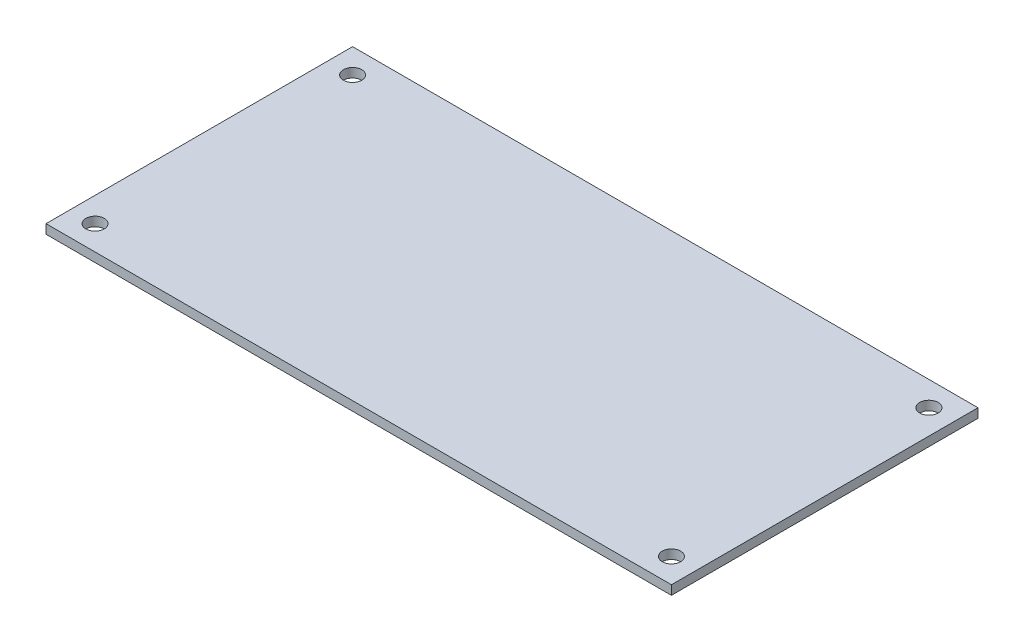
ISO-10303-21;
HEADER;
FILE_DESCRIPTION(('STEP AP214'),'2;1');
FILE_NAME('part.step','',(''),(''),'','','');
FILE_SCHEMA(('AUTOMOTIVE_DESIGN { 1 0 10303 214 1 1 1 1 }'));
ENDSEC;
DATA;
#1=APPLICATION_CONTEXT('core data for automotive mechanical design processes');
#2=APPLICATION_PROTOCOL_DEFINITION('international standard','automotive_design',2000,#1);
#3=PRODUCT_CONTEXT('',#1,'mechanical');
#4=PRODUCT('Part','Part','',(#3));
#5=PRODUCT_RELATED_PRODUCT_CATEGORY('part','',(#4));
#6=PRODUCT_DEFINITION_FORMATION('','',#4);
#7=PRODUCT_DEFINITION_CONTEXT('part definition',#1,'design');
#8=PRODUCT_DEFINITION('design','',#6,#7);
#9=PRODUCT_DEFINITION_SHAPE('','',#8);
#10=(LENGTH_UNIT() NAMED_UNIT(*) SI_UNIT(.MILLI.,.METRE.));
#11=(NAMED_UNIT(*) PLANE_ANGLE_UNIT() SI_UNIT($,.RADIAN.));
#12=(NAMED_UNIT(*) SI_UNIT($,.STERADIAN.) SOLID_ANGLE_UNIT());
#13=UNCERTAINTY_MEASURE_WITH_UNIT(LENGTH_MEASURE(1.E-05),#10,'distance_accuracy_value','');
#14=(GEOMETRIC_REPRESENTATION_CONTEXT(3) GLOBAL_UNCERTAINTY_ASSIGNED_CONTEXT((#13)) GLOBAL_UNIT_ASSIGNED_CONTEXT((#10,
#11,#12)) REPRESENTATION_CONTEXT('',''));
#15=CARTESIAN_POINT('',(0.,0.,0.));
#16=DIRECTION('',(0.,0.,1.));
#17=DIRECTION('',(1.,0.,0.));
#18=AXIS2_PLACEMENT_3D('',#15,#16,#17);
#19=CARTESIAN_POINT('',(0.,1.5,0.));
#20=DIRECTION('',(0.,-1.,0.));
#21=DIRECTION('',(0.,0.,-1.));
#22=AXIS2_PLACEMENT_3D('',#19,#20,#21);
#23=PLANE('',#22);
#24=CARTESIAN_POINT('',(47.,1.5,21.));
#25=DIRECTION('',(0.,1.,0.));
#26=DIRECTION('',(0.,0.,1.));
#27=AXIS2_PLACEMENT_3D('',#24,#25,#26);
#28=CIRCLE('',#27,1.5);
#29=CARTESIAN_POINT('',(47.,1.5,22.5));
#30=VERTEX_POINT('',#29);
#31=EDGE_CURVE('E120',#30,#30,#28,.T.);
#32=ORIENTED_EDGE('',*,*,#31,.F.);
#33=EDGE_LOOP('',(#32));
#34=FACE_BOUND('',#33,.T.);
#35=CARTESIAN_POINT('',(-47.,1.5,-21.));
#36=DIRECTION('',(0.,1.,0.));
#37=DIRECTION('',(0.,0.,1.));
#38=AXIS2_PLACEMENT_3D('',#35,#36,#37);
#39=CIRCLE('',#38,1.5);
#40=CARTESIAN_POINT('',(-47.,1.5,-19.5));
#41=VERTEX_POINT('',#40);
#42=EDGE_CURVE('E99',#41,#41,#39,.T.);
#43=ORIENTED_EDGE('',*,*,#42,.F.);
#44=EDGE_LOOP('',(#43));
#45=FACE_BOUND('',#44,.T.);
#46=DIRECTION('',(0.,0.,-1.));
#47=VECTOR('',#46,1.);
#48=CARTESIAN_POINT('',(51.,1.5,25.));
#49=LINE('',#48,#47);
#50=CARTESIAN_POINT('',(51.,1.5,25.));
#51=VERTEX_POINT('',#50);
#52=CARTESIAN_POINT('',(51.,1.5,-25.));
#53=VERTEX_POINT('',#52);
#54=EDGE_CURVE('E84',#51,#53,#49,.T.);
#55=ORIENTED_EDGE('',*,*,#54,.T.);
#56=DIRECTION('',(-1.,0.,0.));
#57=VECTOR('',#56,1.);
#58=CARTESIAN_POINT('',(-51.,1.5,-25.));
#59=LINE('',#58,#57);
#60=CARTESIAN_POINT('',(-51.,1.5,-25.));
#61=VERTEX_POINT('',#60);
#62=EDGE_CURVE('E79',#53,#61,#59,.T.);
#63=ORIENTED_EDGE('',*,*,#62,.T.);
#64=DIRECTION('',(0.,0.,1.));
#65=VECTOR('',#64,1.);
#66=CARTESIAN_POINT('',(-51.,1.5,25.));
#67=LINE('',#66,#65);
#68=CARTESIAN_POINT('',(-51.,1.5,25.));
#69=VERTEX_POINT('',#68);
#70=EDGE_CURVE('E82',#61,#69,#67,.T.);
#71=ORIENTED_EDGE('',*,*,#70,.T.);
#72=DIRECTION('',(1.,0.,0.));
#73=VECTOR('',#72,1.);
#74=CARTESIAN_POINT('',(-51.,1.5,25.));
#75=LINE('',#74,#73);
#76=EDGE_CURVE('E49',#69,#51,#75,.T.);
#77=ORIENTED_EDGE('',*,*,#76,.T.);
#78=EDGE_LOOP('',(#55,#63,#71,#77));
#79=FACE_BOUND('',#78,.T.);
#80=CARTESIAN_POINT('',(47.,1.5,-21.));
#81=DIRECTION('',(0.,1.,0.));
#82=DIRECTION('',(0.,0.,-1.));
#83=AXIS2_PLACEMENT_3D('',#80,#81,#82);
#84=CIRCLE('',#83,1.5);
#85=CARTESIAN_POINT('',(47.,1.5,-22.5));
#86=VERTEX_POINT('',#85);
#87=EDGE_CURVE('E114',#86,#86,#84,.T.);
#88=ORIENTED_EDGE('',*,*,#87,.F.);
#89=EDGE_LOOP('',(#88));
#90=FACE_BOUND('',#89,.T.);
#91=CARTESIAN_POINT('',(-47.,1.5,21.));
#92=DIRECTION('',(0.,1.,0.));
#93=DIRECTION('',(0.,0.,-1.));
#94=AXIS2_PLACEMENT_3D('',#91,#92,#93);
#95=CIRCLE('',#94,1.5);
#96=CARTESIAN_POINT('',(-47.,1.5,19.5));
#97=VERTEX_POINT('',#96);
#98=EDGE_CURVE('E126',#97,#97,#95,.T.);
#99=ORIENTED_EDGE('',*,*,#98,.F.);
#100=EDGE_LOOP('',(#99));
#101=FACE_BOUND('',#100,.T.);
#102=ADVANCED_FACE('F32',(#34,#45,#79,#90,#101),#23,.F.);
#103=CARTESIAN_POINT('',(0.,0.,0.));
#104=DIRECTION('',(0.,-1.,0.));
#105=DIRECTION('',(0.,0.,-1.));
#106=AXIS2_PLACEMENT_3D('',#103,#104,#105);
#107=PLANE('',#106);
#108=CARTESIAN_POINT('',(47.,0.,21.));
#109=DIRECTION('',(0.,1.,0.));
#110=DIRECTION('',(0.,0.,1.));
#111=AXIS2_PLACEMENT_3D('',#108,#109,#110);
#112=CIRCLE('',#111,1.5);
#113=CARTESIAN_POINT('',(47.,0.,22.5));
#114=VERTEX_POINT('',#113);
#115=EDGE_CURVE('E123',#114,#114,#112,.T.);
#116=ORIENTED_EDGE('',*,*,#115,.T.);
#117=EDGE_LOOP('',(#116));
#118=FACE_BOUND('',#117,.T.);
#119=CARTESIAN_POINT('',(-47.,0.,-21.));
#120=DIRECTION('',(0.,1.,0.));
#121=DIRECTION('',(0.,0.,1.));
#122=AXIS2_PLACEMENT_3D('',#119,#120,#121);
#123=CIRCLE('',#122,1.5);
#124=CARTESIAN_POINT('',(-47.,0.,-19.5));
#125=VERTEX_POINT('',#124);
#126=EDGE_CURVE('E111',#125,#125,#123,.T.);
#127=ORIENTED_EDGE('',*,*,#126,.T.);
#128=EDGE_LOOP('',(#127));
#129=FACE_BOUND('',#128,.T.);
#130=DIRECTION('',(0.,0.,-1.));
#131=VECTOR('',#130,1.);
#132=CARTESIAN_POINT('',(51.,0.,25.));
#133=LINE('',#132,#131);
#134=CARTESIAN_POINT('',(51.,0.,25.));
#135=VERTEX_POINT('',#134);
#136=CARTESIAN_POINT('',(51.,0.,-25.));
#137=VERTEX_POINT('',#136);
#138=EDGE_CURVE('E96',#135,#137,#133,.T.);
#139=ORIENTED_EDGE('',*,*,#138,.F.);
#140=DIRECTION('',(1.,0.,0.));
#141=VECTOR('',#140,1.);
#142=CARTESIAN_POINT('',(-51.,0.,25.));
#143=LINE('',#142,#141);
#144=CARTESIAN_POINT('',(-51.,0.,25.));
#145=VERTEX_POINT('',#144);
#146=EDGE_CURVE('E72',#145,#135,#143,.T.);
#147=ORIENTED_EDGE('',*,*,#146,.F.);
#148=DIRECTION('',(0.,0.,1.));
#149=VECTOR('',#148,1.);
#150=CARTESIAN_POINT('',(-51.,0.,25.));
#151=LINE('',#150,#149);
#152=CARTESIAN_POINT('',(-51.,0.,-25.));
#153=VERTEX_POINT('',#152);
#154=EDGE_CURVE('E66',#153,#145,#151,.T.);
#155=ORIENTED_EDGE('',*,*,#154,.F.);
#156=DIRECTION('',(-1.,0.,0.));
#157=VECTOR('',#156,1.);
#158=CARTESIAN_POINT('',(-51.,0.,-25.));
#159=LINE('',#158,#157);
#160=EDGE_CURVE('E88',#137,#153,#159,.T.);
#161=ORIENTED_EDGE('',*,*,#160,.F.);
#162=EDGE_LOOP('',(#139,#147,#155,#161));
#163=FACE_BOUND('',#162,.T.);
#164=CARTESIAN_POINT('',(47.,0.,-21.));
#165=DIRECTION('',(0.,1.,0.));
#166=DIRECTION('',(0.,0.,-1.));
#167=AXIS2_PLACEMENT_3D('',#164,#165,#166);
#168=CIRCLE('',#167,1.5);
#169=CARTESIAN_POINT('',(47.,0.,-22.5));
#170=VERTEX_POINT('',#169);
#171=EDGE_CURVE('E117',#170,#170,#168,.T.);
#172=ORIENTED_EDGE('',*,*,#171,.T.);
#173=EDGE_LOOP('',(#172));
#174=FACE_BOUND('',#173,.T.);
#175=CARTESIAN_POINT('',(-47.,0.,21.));
#176=DIRECTION('',(0.,1.,0.));
#177=DIRECTION('',(0.,0.,-1.));
#178=AXIS2_PLACEMENT_3D('',#175,#176,#177);
#179=CIRCLE('',#178,1.5);
#180=CARTESIAN_POINT('',(-47.,0.,19.5));
#181=VERTEX_POINT('',#180);
#182=EDGE_CURVE('E129',#181,#181,#179,.T.);
#183=ORIENTED_EDGE('',*,*,#182,.T.);
#184=EDGE_LOOP('',(#183));
#185=FACE_BOUND('',#184,.T.);
#186=ADVANCED_FACE('F107',(#118,#129,#163,#174,#185),#107,.T.);
#187=CARTESIAN_POINT('',(51.,1.5,25.));
#188=DIRECTION('',(-1.,0.,0.));
#189=DIRECTION('',(0.,0.,1.));
#190=AXIS2_PLACEMENT_3D('',#187,#188,#189);
#191=PLANE('',#190);
#192=ORIENTED_EDGE('',*,*,#138,.T.);
#193=DIRECTION('',(0.,-1.,0.));
#194=VECTOR('',#193,1.);
#195=CARTESIAN_POINT('',(51.,1.5,-25.));
#196=LINE('',#195,#194);
#197=EDGE_CURVE('E11',#53,#137,#196,.T.);
#198=ORIENTED_EDGE('',*,*,#197,.F.);
#199=ORIENTED_EDGE('',*,*,#54,.F.);
#200=DIRECTION('',(0.,-1.,0.));
#201=VECTOR('',#200,1.);
#202=CARTESIAN_POINT('',(51.,1.5,25.));
#203=LINE('',#202,#201);
#204=EDGE_CURVE('E92',#51,#135,#203,.T.);
#205=ORIENTED_EDGE('',*,*,#204,.T.);
#206=EDGE_LOOP('',(#192,#198,#199,#205));
#207=FACE_BOUND('',#206,.T.);
#208=ADVANCED_FACE('F34',(#207),#191,.F.);
#209=CARTESIAN_POINT('',(-51.,1.5,-25.));
#210=DIRECTION('',(0.,0.,1.));
#211=DIRECTION('',(1.,0.,0.));
#212=AXIS2_PLACEMENT_3D('',#209,#210,#211);
#213=PLANE('',#212);
#214=ORIENTED_EDGE('',*,*,#160,.T.);
#215=DIRECTION('',(0.,-1.,0.));
#216=VECTOR('',#215,1.);
#217=CARTESIAN_POINT('',(-51.,1.5,-25.));
#218=LINE('',#217,#216);
#219=EDGE_CURVE('E41',#61,#153,#218,.T.);
#220=ORIENTED_EDGE('',*,*,#219,.F.);
#221=ORIENTED_EDGE('',*,*,#62,.F.);
#222=ORIENTED_EDGE('',*,*,#197,.T.);
#223=EDGE_LOOP('',(#214,#220,#221,#222));
#224=FACE_BOUND('',#223,.T.);
#225=ADVANCED_FACE('F87',(#224),#213,.F.);
#226=CARTESIAN_POINT('',(-51.,1.5,25.));
#227=DIRECTION('',(1.,0.,0.));
#228=DIRECTION('',(0.,0.,-1.));
#229=AXIS2_PLACEMENT_3D('',#226,#227,#228);
#230=PLANE('',#229);
#231=ORIENTED_EDGE('',*,*,#154,.T.);
#232=DIRECTION('',(0.,-1.,0.));
#233=VECTOR('',#232,1.);
#234=CARTESIAN_POINT('',(-51.,1.5,25.));
#235=LINE('',#234,#233);
#236=EDGE_CURVE('E89',#69,#145,#235,.T.);
#237=ORIENTED_EDGE('',*,*,#236,.F.);
#238=ORIENTED_EDGE('',*,*,#70,.F.);
#239=ORIENTED_EDGE('',*,*,#219,.T.);
#240=EDGE_LOOP('',(#231,#237,#238,#239));
#241=FACE_BOUND('',#240,.T.);
#242=ADVANCED_FACE('F90',(#241),#230,.F.);
#243=CARTESIAN_POINT('',(-51.,1.5,25.));
#244=DIRECTION('',(0.,0.,-1.));
#245=DIRECTION('',(-1.,0.,0.));
#246=AXIS2_PLACEMENT_3D('',#243,#244,#245);
#247=PLANE('',#246);
#248=ORIENTED_EDGE('',*,*,#146,.T.);
#249=ORIENTED_EDGE('',*,*,#204,.F.);
#250=ORIENTED_EDGE('',*,*,#76,.F.);
#251=ORIENTED_EDGE('',*,*,#236,.T.);
#252=EDGE_LOOP('',(#248,#249,#250,#251));
#253=FACE_BOUND('',#252,.T.);
#254=ADVANCED_FACE('F104',(#253),#247,.F.);
#255=CARTESIAN_POINT('',(-47.,1.5,-21.));
#256=DIRECTION('',(0.,-1.,0.));
#257=DIRECTION('',(0.,0.,-1.));
#258=AXIS2_PLACEMENT_3D('',#255,#256,#257);
#259=CYLINDRICAL_SURFACE('',#258,1.5);
#260=ORIENTED_EDGE('',*,*,#42,.T.);
#261=EDGE_LOOP('',(#260));
#262=FACE_BOUND('',#261,.T.);
#263=ORIENTED_EDGE('',*,*,#126,.F.);
#264=EDGE_LOOP('',(#263));
#265=FACE_BOUND('',#264,.T.);
#266=ADVANCED_FACE('F149',(#262,#265),#259,.F.);
#267=CARTESIAN_POINT('',(47.,1.5,-21.));
#268=DIRECTION('',(0.,-1.,0.));
#269=DIRECTION('',(0.,0.,-1.));
#270=AXIS2_PLACEMENT_3D('',#267,#268,#269);
#271=CYLINDRICAL_SURFACE('',#270,1.5);
#272=ORIENTED_EDGE('',*,*,#87,.T.);
#273=EDGE_LOOP('',(#272));
#274=FACE_BOUND('',#273,.T.);
#275=ORIENTED_EDGE('',*,*,#171,.F.);
#276=EDGE_LOOP('',(#275));
#277=FACE_BOUND('',#276,.T.);
#278=ADVANCED_FACE('F195',(#274,#277),#271,.F.);
#279=CARTESIAN_POINT('',(47.,1.5,21.));
#280=DIRECTION('',(0.,-1.,0.));
#281=DIRECTION('',(0.,0.,-1.));
#282=AXIS2_PLACEMENT_3D('',#279,#280,#281);
#283=CYLINDRICAL_SURFACE('',#282,1.5);
#284=ORIENTED_EDGE('',*,*,#31,.T.);
#285=EDGE_LOOP('',(#284));
#286=FACE_BOUND('',#285,.T.);
#287=ORIENTED_EDGE('',*,*,#115,.F.);
#288=EDGE_LOOP('',(#287));
#289=FACE_BOUND('',#288,.T.);
#290=ADVANCED_FACE('F203',(#286,#289),#283,.F.);
#291=CARTESIAN_POINT('',(-47.,1.5,21.));
#292=DIRECTION('',(0.,-1.,0.));
#293=DIRECTION('',(0.,0.,-1.));
#294=AXIS2_PLACEMENT_3D('',#291,#292,#293);
#295=CYLINDRICAL_SURFACE('',#294,1.5);
#296=ORIENTED_EDGE('',*,*,#98,.T.);
#297=EDGE_LOOP('',(#296));
#298=FACE_BOUND('',#297,.T.);
#299=ORIENTED_EDGE('',*,*,#182,.F.);
#300=EDGE_LOOP('',(#299));
#301=FACE_BOUND('',#300,.T.);
#302=ADVANCED_FACE('F135',(#298,#301),#295,.F.);
#303=CLOSED_SHELL('',(#102,#186,#208,#225,#242,#254,#266,#278,#290,#302));
#304=MANIFOLD_SOLID_BREP('B2',#303);
#305=ADVANCED_BREP_SHAPE_REPRESENTATION('',(#18,#304),#14);
#306=SHAPE_DEFINITION_REPRESENTATION(#9,#305);
ENDSEC;
END-ISO-10303-21;
